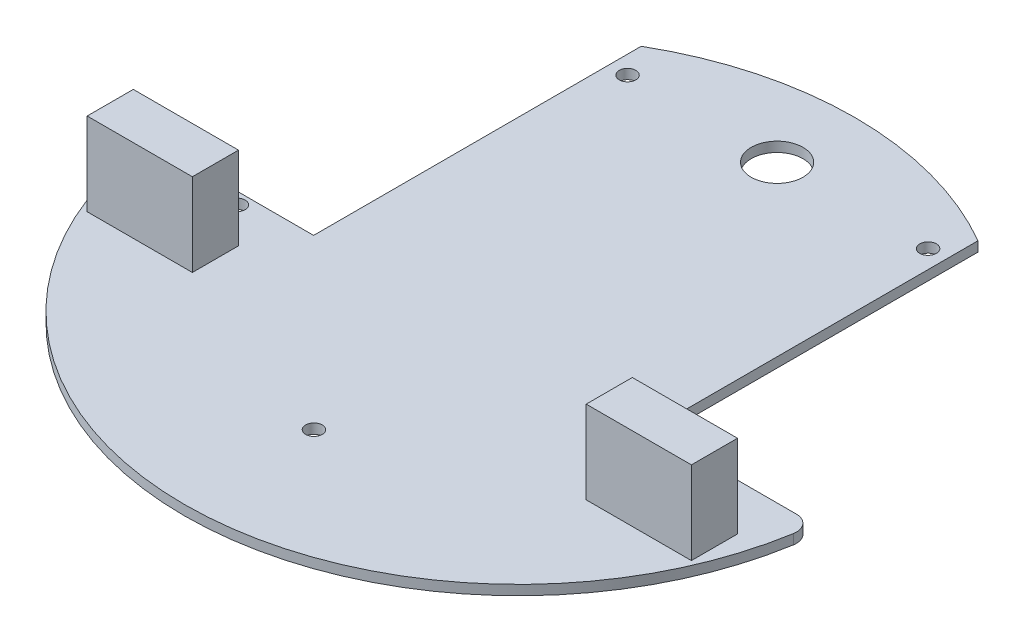
ISO-10303-21;
HEADER;
FILE_DESCRIPTION(('STEP AP214'),'2;1');
FILE_NAME('part.step','',(''),(''),'','','');
FILE_SCHEMA(('AUTOMOTIVE_DESIGN { 1 0 10303 214 1 1 1 1 }'));
ENDSEC;
DATA;
#1=APPLICATION_CONTEXT('core data for automotive mechanical design processes');
#2=APPLICATION_PROTOCOL_DEFINITION('international standard','automotive_design',2000,#1);
#3=PRODUCT_CONTEXT('',#1,'mechanical');
#4=PRODUCT('Part','Part','',(#3));
#5=PRODUCT_RELATED_PRODUCT_CATEGORY('part','',(#4));
#6=PRODUCT_DEFINITION_FORMATION('','',#4);
#7=PRODUCT_DEFINITION_CONTEXT('part definition',#1,'design');
#8=PRODUCT_DEFINITION('design','',#6,#7);
#9=PRODUCT_DEFINITION_SHAPE('','',#8);
#10=(LENGTH_UNIT() NAMED_UNIT(*) SI_UNIT(.MILLI.,.METRE.));
#11=(NAMED_UNIT(*) PLANE_ANGLE_UNIT() SI_UNIT($,.RADIAN.));
#12=(NAMED_UNIT(*) SI_UNIT($,.STERADIAN.) SOLID_ANGLE_UNIT());
#13=UNCERTAINTY_MEASURE_WITH_UNIT(LENGTH_MEASURE(1.E-05),#10,'distance_accuracy_value','');
#14=(GEOMETRIC_REPRESENTATION_CONTEXT(3) GLOBAL_UNCERTAINTY_ASSIGNED_CONTEXT((#13)) GLOBAL_UNIT_ASSIGNED_CONTEXT((#10,
#11,#12)) REPRESENTATION_CONTEXT('',''));
#15=CARTESIAN_POINT('',(0.,0.,0.));
#16=DIRECTION('',(0.,0.,1.));
#17=DIRECTION('',(1.,0.,0.));
#18=AXIS2_PLACEMENT_3D('',#15,#16,#17);
#19=CARTESIAN_POINT('',(0.,1.9,0.));
#20=DIRECTION('',(0.,-1.,0.));
#21=DIRECTION('',(0.,0.,-1.));
#22=AXIS2_PLACEMENT_3D('',#19,#20,#21);
#23=PLANE('',#22);
#24=DIRECTION('',(0.,0.,-1.));
#25=VECTOR('',#24,1.);
#26=CARTESIAN_POINT('',(58.3,1.9,42.2748186237033));
#27=LINE('',#26,#25);
#28=CARTESIAN_POINT('',(58.3,1.9,51.1748186237033));
#29=VERTEX_POINT('',#28);
#30=CARTESIAN_POINT('',(58.3,1.9,42.2748186237033));
#31=VERTEX_POINT('',#30);
#32=EDGE_CURVE('E168',#29,#31,#27,.T.);
#33=ORIENTED_EDGE('',*,*,#32,.F.);
#34=DIRECTION('',(1.,0.,0.));
#35=VECTOR('',#34,1.);
#36=CARTESIAN_POINT('',(58.3,1.9,51.1748186237033));
#37=LINE('',#36,#35);
#38=CARTESIAN_POINT('',(38.,1.9,51.1748186237033));
#39=VERTEX_POINT('',#38);
#40=EDGE_CURVE('E181',#39,#29,#37,.T.);
#41=ORIENTED_EDGE('',*,*,#40,.F.);
#42=DIRECTION('',(0.,0.,1.));
#43=VECTOR('',#42,1.);
#44=CARTESIAN_POINT('',(38.,1.9,42.2748186237033));
#45=LINE('',#44,#43);
#46=CARTESIAN_POINT('',(38.,1.9,42.2748186237033));
#47=VERTEX_POINT('',#46);
#48=EDGE_CURVE('E190',#47,#39,#45,.T.);
#49=ORIENTED_EDGE('',*,*,#48,.F.);
#50=DIRECTION('',(-1.,0.,0.));
#51=VECTOR('',#50,1.);
#52=CARTESIAN_POINT('',(58.3,1.9,42.2748186237033));
#53=LINE('',#52,#51);
#54=EDGE_CURVE('E171',#31,#47,#53,.T.);
#55=ORIENTED_EDGE('',*,*,#54,.F.);
#56=EDGE_LOOP('',(#33,#41,#49,#55));
#57=FACE_BOUND('',#56,.T.);
#58=CARTESIAN_POINT('',(29.,1.9,-23.8048236912251));
#59=DIRECTION('',(0.,1.,0.));
#60=DIRECTION('',(0.,0.,-1.));
#61=AXIS2_PLACEMENT_3D('',#58,#59,#60);
#62=CIRCLE('',#61,1.6);
#63=CARTESIAN_POINT('',(29.,1.9,-25.4048236912251));
#64=VERTEX_POINT('',#63);
#65=EDGE_CURVE('E206',#64,#64,#62,.T.);
#66=ORIENTED_EDGE('',*,*,#65,.F.);
#67=EDGE_LOOP('',(#66));
#68=FACE_BOUND('',#67,.T.);
#69=CARTESIAN_POINT('',(-29.,1.9,-23.8048236912251));
#70=DIRECTION('',(0.,1.,0.));
#71=DIRECTION('',(0.,0.,1.));
#72=AXIS2_PLACEMENT_3D('',#69,#70,#71);
#73=CIRCLE('',#72,1.6);
#74=CARTESIAN_POINT('',(-29.,1.9,-22.2048236912251));
#75=VERTEX_POINT('',#74);
#76=EDGE_CURVE('E212',#75,#75,#73,.T.);
#77=ORIENTED_EDGE('',*,*,#76,.F.);
#78=EDGE_LOOP('',(#77));
#79=FACE_BOUND('',#78,.T.);
#80=CARTESIAN_POINT('',(45.,1.9,35.5743022047236));
#81=DIRECTION('',(0.,1.,0.));
#82=DIRECTION('',(0.,0.,-1.));
#83=AXIS2_PLACEMENT_3D('',#80,#81,#82);
#84=CIRCLE('',#83,1.6);
#85=CARTESIAN_POINT('',(45.,1.9,33.9743022047236));
#86=VERTEX_POINT('',#85);
#87=EDGE_CURVE('E218',#86,#86,#84,.T.);
#88=ORIENTED_EDGE('',*,*,#87,.F.);
#89=EDGE_LOOP('',(#88));
#90=FACE_BOUND('',#89,.T.);
#91=CARTESIAN_POINT('',(-44.9999999999999,1.9,35.5743022047236));
#92=DIRECTION('',(0.,1.,0.));
#93=DIRECTION('',(0.,0.,1.));
#94=AXIS2_PLACEMENT_3D('',#91,#92,#93);
#95=CIRCLE('',#94,1.6);
#96=CARTESIAN_POINT('',(-44.9999999999999,1.9,37.1743022047236));
#97=VERTEX_POINT('',#96);
#98=EDGE_CURVE('E224',#97,#97,#95,.T.);
#99=ORIENTED_EDGE('',*,*,#98,.F.);
#100=EDGE_LOOP('',(#99));
#101=FACE_BOUND('',#100,.T.);
#102=CARTESIAN_POINT('',(0.,1.9,65.7186660190556));
#103=DIRECTION('',(0.,1.,0.));
#104=DIRECTION('',(0.,0.,1.));
#105=AXIS2_PLACEMENT_3D('',#102,#103,#104);
#106=CIRCLE('',#105,1.6);
#107=CARTESIAN_POINT('',(0.,1.9,67.3186660190556));
#108=VERTEX_POINT('',#107);
#109=EDGE_CURVE('E230',#108,#108,#106,.T.);
#110=ORIENTED_EDGE('',*,*,#109,.F.);
#111=EDGE_LOOP('',(#110));
#112=FACE_BOUND('',#111,.T.);
#113=CARTESIAN_POINT('',(0.,1.9,-23.660459876893));
#114=DIRECTION('',(0.,1.,0.));
#115=DIRECTION('',(0.,0.,1.));
#116=AXIS2_PLACEMENT_3D('',#113,#114,#115);
#117=CIRCLE('',#116,5.);
#118=CARTESIAN_POINT('',(0.,1.9,-18.660459876893));
#119=VERTEX_POINT('',#118);
#120=EDGE_CURVE('E236',#119,#119,#117,.T.);
#121=ORIENTED_EDGE('',*,*,#120,.F.);
#122=EDGE_LOOP('',(#121));
#123=FACE_BOUND('',#122,.T.);
#124=DIRECTION('',(0.,0.,1.));
#125=VECTOR('',#124,1.);
#126=CARTESIAN_POINT('',(32.5,1.9,-26.7251813762967));
#127=LINE('',#126,#125);
#128=CARTESIAN_POINT('',(32.5,1.9,-29.933368467883));
#129=VERTEX_POINT('',#128);
#130=CARTESIAN_POINT('',(32.5,1.9,33.2748186237033));
#131=VERTEX_POINT('',#130);
#132=EDGE_CURVE('E252',#129,#131,#127,.T.);
#133=ORIENTED_EDGE('',*,*,#132,.F.);
#134=CARTESIAN_POINT('',(-1.65310506335159E-13,1.9,26.2186660190557));
#135=DIRECTION('',(0.,-1.,0.));
#136=DIRECTION('',(0.,0.,1.));
#137=AXIS2_PLACEMENT_3D('',#134,#135,#136);
#138=CIRCLE('',#137,64.8791258959487);
#139=CARTESIAN_POINT('',(-32.5,1.9,-29.9333684678832));
#140=VERTEX_POINT('',#139);
#141=EDGE_CURVE('E249',#140,#129,#138,.T.);
#142=ORIENTED_EDGE('',*,*,#141,.F.);
#143=DIRECTION('',(0.,0.,-1.));
#144=VECTOR('',#143,1.);
#145=CARTESIAN_POINT('',(-32.5,1.9,-26.7251813762967));
#146=LINE('',#145,#144);
#147=CARTESIAN_POINT('',(-32.5,1.9,33.2748186237033));
#148=VERTEX_POINT('',#147);
#149=EDGE_CURVE('E271',#148,#140,#146,.T.);
#150=ORIENTED_EDGE('',*,*,#149,.F.);
#151=DIRECTION('',(1.,0.,0.));
#152=VECTOR('',#151,1.);
#153=CARTESIAN_POINT('',(-32.5,1.9,33.2748186237033));
#154=LINE('',#153,#152);
#155=CARTESIAN_POINT('',(-60.6722654496439,1.9,33.2748186237033));
#156=VERTEX_POINT('',#155);
#157=EDGE_CURVE('E268',#156,#148,#154,.T.);
#158=ORIENTED_EDGE('',*,*,#157,.F.);
#159=CARTESIAN_POINT('',(-60.6722654496439,1.9,36.2748186237033));
#160=DIRECTION('',(0.,-1.,0.));
#161=DIRECTION('',(0.,0.,1.));
#162=AXIS2_PLACEMENT_3D('',#159,#160,#161);
#163=CIRCLE('',#162,3.);
#164=CARTESIAN_POINT('',(-63.6318881545046,1.9,36.7653626531983));
#165=VERTEX_POINT('',#164);
#166=EDGE_CURVE('E265',#165,#156,#163,.T.);
#167=ORIENTED_EDGE('',*,*,#166,.F.);
#168=CARTESIAN_POINT('',(-1.65310506335159E-13,1.9,26.2186660190557));
#169=DIRECTION('',(0.,-1.,0.));
#170=DIRECTION('',(0.,0.,-1.));
#171=AXIS2_PLACEMENT_3D('',#168,#169,#170);
#172=CIRCLE('',#171,64.5);
#173=CARTESIAN_POINT('',(63.6318881545043,1.9,36.7653626531983));
#174=VERTEX_POINT('',#173);
#175=EDGE_CURVE('E262',#174,#165,#172,.T.);
#176=ORIENTED_EDGE('',*,*,#175,.F.);
#177=CARTESIAN_POINT('',(60.6722654496436,1.9,36.2748186237033));
#178=DIRECTION('',(0.,-1.,0.));
#179=DIRECTION('',(0.,0.,-1.));
#180=AXIS2_PLACEMENT_3D('',#177,#178,#179);
#181=CIRCLE('',#180,3.00000000000001);
#182=CARTESIAN_POINT('',(60.6722654496436,1.9,33.2748186237033));
#183=VERTEX_POINT('',#182);
#184=EDGE_CURVE('E259',#183,#174,#181,.T.);
#185=ORIENTED_EDGE('',*,*,#184,.F.);
#186=DIRECTION('',(1.,0.,0.));
#187=VECTOR('',#186,1.);
#188=CARTESIAN_POINT('',(32.5,1.9,33.2748186237033));
#189=LINE('',#188,#187);
#190=EDGE_CURVE('E256',#131,#183,#189,.T.);
#191=ORIENTED_EDGE('',*,*,#190,.F.);
#192=EDGE_LOOP('',(#133,#142,#150,#158,#167,#176,#185,#191));
#193=FACE_BOUND('',#192,.T.);
#194=DIRECTION('',(-1.,0.,0.));
#195=VECTOR('',#194,1.);
#196=CARTESIAN_POINT('',(-58.3,1.9,42.2748186237033));
#197=LINE('',#196,#195);
#198=CARTESIAN_POINT('',(-38.,1.9,42.2748186237033));
#199=VERTEX_POINT('',#198);
#200=CARTESIAN_POINT('',(-58.3,1.9,42.2748186237033));
#201=VERTEX_POINT('',#200);
#202=EDGE_CURVE('E167',#199,#201,#197,.T.);
#203=ORIENTED_EDGE('',*,*,#202,.F.);
#204=DIRECTION('',(0.,0.,-1.));
#205=VECTOR('',#204,1.);
#206=CARTESIAN_POINT('',(-38.,1.9,42.2748186237033));
#207=LINE('',#206,#205);
#208=CARTESIAN_POINT('',(-38.,1.9,51.1748186237033));
#209=VERTEX_POINT('',#208);
#210=EDGE_CURVE('E164',#209,#199,#207,.T.);
#211=ORIENTED_EDGE('',*,*,#210,.F.);
#212=DIRECTION('',(1.,0.,0.));
#213=VECTOR('',#212,1.);
#214=CARTESIAN_POINT('',(-58.3,1.9,51.1748186237033));
#215=LINE('',#214,#213);
#216=CARTESIAN_POINT('',(-58.3,1.9,51.1748186237033));
#217=VERTEX_POINT('',#216);
#218=EDGE_CURVE('E55',#217,#209,#215,.T.);
#219=ORIENTED_EDGE('',*,*,#218,.F.);
#220=DIRECTION('',(0.,0.,1.));
#221=VECTOR('',#220,1.);
#222=CARTESIAN_POINT('',(-58.3,1.9,42.2748186237033));
#223=LINE('',#222,#221);
#224=EDGE_CURVE('E50',#201,#217,#223,.T.);
#225=ORIENTED_EDGE('',*,*,#224,.F.);
#226=EDGE_LOOP('',(#203,#211,#219,#225));
#227=FACE_BOUND('',#226,.T.);
#228=ADVANCED_FACE('F33',(#57,#68,#79,#90,#101,#112,#123,#193,#227),#23,.F.);
#229=CARTESIAN_POINT('',(-1.65310506335159E-13,1.9,26.2186660190557));
#230=DIRECTION('',(0.,-1.,0.));
#231=DIRECTION('',(0.,0.,-1.));
#232=AXIS2_PLACEMENT_3D('',#229,#230,#231);
#233=CYLINDRICAL_SURFACE('',#232,64.8791258959487);
#234=DIRECTION('',(0.,-1.,0.));
#235=VECTOR('',#234,1.);
#236=CARTESIAN_POINT('',(32.5,1.9,-29.933368467883));
#237=LINE('',#236,#235);
#238=CARTESIAN_POINT('',(32.5,0.,-29.933368467883));
#239=VERTEX_POINT('',#238);
#240=EDGE_CURVE('E242',#239,#129,#237,.F.);
#241=ORIENTED_EDGE('',*,*,#240,.F.);
#242=CARTESIAN_POINT('',(-1.65310506335159E-13,0.,26.2186660190557));
#243=DIRECTION('',(0.,-1.,0.));
#244=DIRECTION('',(0.,0.,1.));
#245=AXIS2_PLACEMENT_3D('',#242,#243,#244);
#246=CIRCLE('',#245,64.8791258959487);
#247=CARTESIAN_POINT('',(-32.5,0.,-29.9333684678832));
#248=VERTEX_POINT('',#247);
#249=EDGE_CURVE('E248',#248,#239,#246,.T.);
#250=ORIENTED_EDGE('',*,*,#249,.F.);
#251=DIRECTION('',(0.,-1.,0.));
#252=VECTOR('',#251,1.);
#253=CARTESIAN_POINT('',(-32.5,1.9,-29.9333684678832));
#254=LINE('',#253,#252);
#255=EDGE_CURVE('E245',#140,#248,#254,.T.);
#256=ORIENTED_EDGE('',*,*,#255,.F.);
#257=ORIENTED_EDGE('',*,*,#141,.T.);
#258=EDGE_LOOP('',(#241,#250,#256,#257));
#259=FACE_BOUND('',#258,.T.);
#260=ADVANCED_FACE('F312',(#259),#233,.T.);
#261=CARTESIAN_POINT('',(-32.5,1.9,-26.7251813762967));
#262=DIRECTION('',(-1.,0.,0.));
#263=DIRECTION('',(0.,0.,1.));
#264=AXIS2_PLACEMENT_3D('',#261,#262,#263);
#265=PLANE('',#264);
#266=DIRECTION('',(0.,0.,-1.));
#267=VECTOR('',#266,1.);
#268=CARTESIAN_POINT('',(-32.5,0.,-26.7251813762967));
#269=LINE('',#268,#267);
#270=CARTESIAN_POINT('',(-32.5,0.,33.2748186237033));
#271=VERTEX_POINT('',#270);
#272=EDGE_CURVE('E253',#271,#248,#269,.T.);
#273=ORIENTED_EDGE('',*,*,#272,.F.);
#274=DIRECTION('',(0.,-1.,0.));
#275=VECTOR('',#274,1.);
#276=CARTESIAN_POINT('',(-32.5,1.9,33.2748186237033));
#277=LINE('',#276,#275);
#278=EDGE_CURVE('E11',#148,#271,#277,.T.);
#279=ORIENTED_EDGE('',*,*,#278,.F.);
#280=ORIENTED_EDGE('',*,*,#149,.T.);
#281=ORIENTED_EDGE('',*,*,#255,.T.);
#282=EDGE_LOOP('',(#273,#279,#280,#281));
#283=FACE_BOUND('',#282,.T.);
#284=ADVANCED_FACE('F332',(#283),#265,.T.);
#285=CARTESIAN_POINT('',(-32.5,1.9,33.2748186237033));
#286=DIRECTION('',(0.,0.,-1.));
#287=DIRECTION('',(-1.,0.,0.));
#288=AXIS2_PLACEMENT_3D('',#285,#286,#287);
#289=PLANE('',#288);
#290=DIRECTION('',(1.,0.,0.));
#291=VECTOR('',#290,1.);
#292=CARTESIAN_POINT('',(-32.5,0.,33.2748186237033));
#293=LINE('',#292,#291);
#294=CARTESIAN_POINT('',(-60.6722654496439,0.,33.2748186237033));
#295=VERTEX_POINT('',#294);
#296=EDGE_CURVE('E290',#295,#271,#293,.T.);
#297=ORIENTED_EDGE('',*,*,#296,.F.);
#298=DIRECTION('',(0.,-1.,0.));
#299=VECTOR('',#298,1.);
#300=CARTESIAN_POINT('',(-60.6722654496439,1.9,33.2748186237033));
#301=LINE('',#300,#299);
#302=EDGE_CURVE('E42',#156,#295,#301,.T.);
#303=ORIENTED_EDGE('',*,*,#302,.F.);
#304=ORIENTED_EDGE('',*,*,#157,.T.);
#305=ORIENTED_EDGE('',*,*,#278,.T.);
#306=EDGE_LOOP('',(#297,#303,#304,#305));
#307=FACE_BOUND('',#306,.T.);
#308=ADVANCED_FACE('F330',(#307),#289,.T.);
#309=CARTESIAN_POINT('',(-60.6722654496439,1.9,36.2748186237033));
#310=DIRECTION('',(0.,-1.,0.));
#311=DIRECTION('',(0.,0.,-1.));
#312=AXIS2_PLACEMENT_3D('',#309,#310,#311);
#313=CYLINDRICAL_SURFACE('',#312,3.);
#314=CARTESIAN_POINT('',(-60.6722654496439,0.,36.2748186237033));
#315=DIRECTION('',(0.,-1.,0.));
#316=DIRECTION('',(0.,0.,1.));
#317=AXIS2_PLACEMENT_3D('',#314,#315,#316);
#318=CIRCLE('',#317,3.);
#319=CARTESIAN_POINT('',(-63.6318881545046,0.,36.7653626531983));
#320=VERTEX_POINT('',#319);
#321=EDGE_CURVE('E287',#320,#295,#318,.T.);
#322=ORIENTED_EDGE('',*,*,#321,.F.);
#323=DIRECTION('',(0.,-1.,0.));
#324=VECTOR('',#323,1.);
#325=CARTESIAN_POINT('',(-63.6318881545046,1.9,36.7653626531983));
#326=LINE('',#325,#324);
#327=EDGE_CURVE('E295',#165,#320,#326,.T.);
#328=ORIENTED_EDGE('',*,*,#327,.F.);
#329=ORIENTED_EDGE('',*,*,#166,.T.);
#330=ORIENTED_EDGE('',*,*,#302,.T.);
#331=EDGE_LOOP('',(#322,#328,#329,#330));
#332=FACE_BOUND('',#331,.T.);
#333=ADVANCED_FACE('F327',(#332),#313,.T.);
#334=CARTESIAN_POINT('',(-1.65310506335159E-13,1.9,26.2186660190557));
#335=DIRECTION('',(0.,-1.,0.));
#336=DIRECTION('',(0.,0.,-1.));
#337=AXIS2_PLACEMENT_3D('',#334,#335,#336);
#338=CYLINDRICAL_SURFACE('',#337,64.5);
#339=CARTESIAN_POINT('',(-1.65310506335159E-13,0.,26.2186660190557));
#340=DIRECTION('',(0.,-1.,0.));
#341=DIRECTION('',(0.,0.,-1.));
#342=AXIS2_PLACEMENT_3D('',#339,#340,#341);
#343=CIRCLE('',#342,64.5);
#344=CARTESIAN_POINT('',(63.6318881545043,0.,36.7653626531983));
#345=VERTEX_POINT('',#344);
#346=EDGE_CURVE('E284',#345,#320,#343,.T.);
#347=ORIENTED_EDGE('',*,*,#346,.F.);
#348=DIRECTION('',(0.,-1.,0.));
#349=VECTOR('',#348,1.);
#350=CARTESIAN_POINT('',(63.6318881545043,1.9,36.7653626531983));
#351=LINE('',#350,#349);
#352=EDGE_CURVE('E297',#174,#345,#351,.T.);
#353=ORIENTED_EDGE('',*,*,#352,.F.);
#354=ORIENTED_EDGE('',*,*,#175,.T.);
#355=ORIENTED_EDGE('',*,*,#327,.T.);
#356=EDGE_LOOP('',(#347,#353,#354,#355));
#357=FACE_BOUND('',#356,.T.);
#358=ADVANCED_FACE('F325',(#357),#338,.T.);
#359=CARTESIAN_POINT('',(60.6722654496436,1.9,36.2748186237033));
#360=DIRECTION('',(0.,-1.,0.));
#361=DIRECTION('',(0.,0.,-1.));
#362=AXIS2_PLACEMENT_3D('',#359,#360,#361);
#363=CYLINDRICAL_SURFACE('',#362,3.00000000000001);
#364=CARTESIAN_POINT('',(60.6722654496436,0.,36.2748186237033));
#365=DIRECTION('',(0.,-1.,0.));
#366=DIRECTION('',(0.,0.,-1.));
#367=AXIS2_PLACEMENT_3D('',#364,#365,#366);
#368=CIRCLE('',#367,3.00000000000001);
#369=CARTESIAN_POINT('',(60.6722654496436,0.,33.2748186237033));
#370=VERTEX_POINT('',#369);
#371=EDGE_CURVE('E281',#370,#345,#368,.T.);
#372=ORIENTED_EDGE('',*,*,#371,.F.);
#373=DIRECTION('',(0.,-1.,0.));
#374=VECTOR('',#373,1.);
#375=CARTESIAN_POINT('',(60.6722654496436,1.9,33.2748186237033));
#376=LINE('',#375,#374);
#377=EDGE_CURVE('E298',#183,#370,#376,.T.);
#378=ORIENTED_EDGE('',*,*,#377,.F.);
#379=ORIENTED_EDGE('',*,*,#184,.T.);
#380=ORIENTED_EDGE('',*,*,#352,.T.);
#381=EDGE_LOOP('',(#372,#378,#379,#380));
#382=FACE_BOUND('',#381,.T.);
#383=ADVANCED_FACE('F321',(#382),#363,.T.);
#384=CARTESIAN_POINT('',(32.5,1.9,33.2748186237033));
#385=DIRECTION('',(0.,0.,-1.));
#386=DIRECTION('',(-1.,0.,0.));
#387=AXIS2_PLACEMENT_3D('',#384,#385,#386);
#388=PLANE('',#387);
#389=DIRECTION('',(1.,0.,0.));
#390=VECTOR('',#389,1.);
#391=CARTESIAN_POINT('',(32.5,0.,33.2748186237033));
#392=LINE('',#391,#390);
#393=CARTESIAN_POINT('',(32.5,0.,33.2748186237033));
#394=VERTEX_POINT('',#393);
#395=EDGE_CURVE('E278',#394,#370,#392,.T.);
#396=ORIENTED_EDGE('',*,*,#395,.F.);
#397=DIRECTION('',(0.,-1.,0.));
#398=VECTOR('',#397,1.);
#399=CARTESIAN_POINT('',(32.5,1.9,33.2748186237033));
#400=LINE('',#399,#398);
#401=EDGE_CURVE('E37',#131,#394,#400,.T.);
#402=ORIENTED_EDGE('',*,*,#401,.F.);
#403=ORIENTED_EDGE('',*,*,#190,.T.);
#404=ORIENTED_EDGE('',*,*,#377,.T.);
#405=EDGE_LOOP('',(#396,#402,#403,#404));
#406=FACE_BOUND('',#405,.T.);
#407=ADVANCED_FACE('F306',(#406),#388,.T.);
#408=CARTESIAN_POINT('',(32.5,1.9,-26.7251813762967));
#409=DIRECTION('',(1.,0.,0.));
#410=DIRECTION('',(0.,0.,-1.));
#411=AXIS2_PLACEMENT_3D('',#408,#409,#410);
#412=PLANE('',#411);
#413=DIRECTION('',(0.,0.,1.));
#414=VECTOR('',#413,1.);
#415=CARTESIAN_POINT('',(32.5,0.,-26.7251813762967));
#416=LINE('',#415,#414);
#417=EDGE_CURVE('E275',#239,#394,#416,.T.);
#418=ORIENTED_EDGE('',*,*,#417,.F.);
#419=ORIENTED_EDGE('',*,*,#240,.T.);
#420=ORIENTED_EDGE('',*,*,#132,.T.);
#421=ORIENTED_EDGE('',*,*,#401,.T.);
#422=EDGE_LOOP('',(#418,#419,#420,#421));
#423=FACE_BOUND('',#422,.T.);
#424=ADVANCED_FACE('F303',(#423),#412,.T.);
#425=CARTESIAN_POINT('',(0.,0.,0.));
#426=DIRECTION('',(0.,-1.,0.));
#427=DIRECTION('',(0.,0.,-1.));
#428=AXIS2_PLACEMENT_3D('',#425,#426,#427);
#429=PLANE('',#428);
#430=CARTESIAN_POINT('',(29.,0.,-23.8048236912251));
#431=DIRECTION('',(0.,-1.,0.));
#432=DIRECTION('',(0.,0.,-1.));
#433=AXIS2_PLACEMENT_3D('',#430,#431,#432);
#434=CIRCLE('',#433,1.6);
#435=CARTESIAN_POINT('',(29.,0.,-25.4048236912251));
#436=VERTEX_POINT('',#435);
#437=EDGE_CURVE('E209',#436,#436,#434,.F.);
#438=ORIENTED_EDGE('',*,*,#437,.T.);
#439=EDGE_LOOP('',(#438));
#440=FACE_BOUND('',#439,.T.);
#441=CARTESIAN_POINT('',(-29.,0.,-23.8048236912251));
#442=DIRECTION('',(0.,-1.,0.));
#443=DIRECTION('',(0.,0.,-1.));
#444=AXIS2_PLACEMENT_3D('',#441,#442,#443);
#445=CIRCLE('',#444,1.6);
#446=CARTESIAN_POINT('',(-29.,0.,-25.4048236912251));
#447=VERTEX_POINT('',#446);
#448=EDGE_CURVE('E215',#447,#447,#445,.F.);
#449=ORIENTED_EDGE('',*,*,#448,.T.);
#450=EDGE_LOOP('',(#449));
#451=FACE_BOUND('',#450,.T.);
#452=CARTESIAN_POINT('',(45.,0.,35.5743022047236));
#453=DIRECTION('',(0.,-1.,0.));
#454=DIRECTION('',(0.,0.,-1.));
#455=AXIS2_PLACEMENT_3D('',#452,#453,#454);
#456=CIRCLE('',#455,1.6);
#457=CARTESIAN_POINT('',(45.,0.,33.9743022047236));
#458=VERTEX_POINT('',#457);
#459=EDGE_CURVE('E221',#458,#458,#456,.F.);
#460=ORIENTED_EDGE('',*,*,#459,.T.);
#461=EDGE_LOOP('',(#460));
#462=FACE_BOUND('',#461,.T.);
#463=CARTESIAN_POINT('',(-44.9999999999999,0.,35.5743022047236));
#464=DIRECTION('',(0.,-1.,0.));
#465=DIRECTION('',(0.,0.,-1.));
#466=AXIS2_PLACEMENT_3D('',#463,#464,#465);
#467=CIRCLE('',#466,1.6);
#468=CARTESIAN_POINT('',(-44.9999999999999,0.,33.9743022047236));
#469=VERTEX_POINT('',#468);
#470=EDGE_CURVE('E227',#469,#469,#467,.F.);
#471=ORIENTED_EDGE('',*,*,#470,.T.);
#472=EDGE_LOOP('',(#471));
#473=FACE_BOUND('',#472,.T.);
#474=CARTESIAN_POINT('',(0.,0.,65.7186660190556));
#475=DIRECTION('',(0.,-1.,0.));
#476=DIRECTION('',(0.,0.,-1.));
#477=AXIS2_PLACEMENT_3D('',#474,#475,#476);
#478=CIRCLE('',#477,1.6);
#479=CARTESIAN_POINT('',(0.,0.,64.1186660190556));
#480=VERTEX_POINT('',#479);
#481=EDGE_CURVE('E233',#480,#480,#478,.F.);
#482=ORIENTED_EDGE('',*,*,#481,.T.);
#483=EDGE_LOOP('',(#482));
#484=FACE_BOUND('',#483,.T.);
#485=CARTESIAN_POINT('',(0.,0.,-23.660459876893));
#486=DIRECTION('',(0.,-1.,0.));
#487=DIRECTION('',(0.,0.,-1.));
#488=AXIS2_PLACEMENT_3D('',#485,#486,#487);
#489=CIRCLE('',#488,5.);
#490=CARTESIAN_POINT('',(0.,0.,-28.660459876893));
#491=VERTEX_POINT('',#490);
#492=EDGE_CURVE('E239',#491,#491,#489,.F.);
#493=ORIENTED_EDGE('',*,*,#492,.T.);
#494=EDGE_LOOP('',(#493));
#495=FACE_BOUND('',#494,.T.);
#496=ORIENTED_EDGE('',*,*,#249,.T.);
#497=ORIENTED_EDGE('',*,*,#417,.T.);
#498=ORIENTED_EDGE('',*,*,#395,.T.);
#499=ORIENTED_EDGE('',*,*,#371,.T.);
#500=ORIENTED_EDGE('',*,*,#346,.T.);
#501=ORIENTED_EDGE('',*,*,#321,.T.);
#502=ORIENTED_EDGE('',*,*,#296,.T.);
#503=ORIENTED_EDGE('',*,*,#272,.T.);
#504=EDGE_LOOP('',(#496,#497,#498,#499,#500,#501,#502,#503));
#505=FACE_BOUND('',#504,.T.);
#506=ADVANCED_FACE('F35',(#440,#451,#462,#473,#484,#495,#505),#429,.T.);
#507=CARTESIAN_POINT('',(0.,-14.142135623731,-23.660459876893));
#508=DIRECTION('',(0.,1.,0.));
#509=DIRECTION('',(0.,0.,1.));
#510=AXIS2_PLACEMENT_3D('',#507,#508,#509);
#511=CYLINDRICAL_SURFACE('',#510,5.);
#512=ORIENTED_EDGE('',*,*,#120,.T.);
#513=EDGE_LOOP('',(#512));
#514=FACE_BOUND('',#513,.T.);
#515=ORIENTED_EDGE('',*,*,#492,.F.);
#516=EDGE_LOOP('',(#515));
#517=FACE_BOUND('',#516,.T.);
#518=ADVANCED_FACE('F385',(#514,#517),#511,.F.);
#519=CARTESIAN_POINT('',(0.,-4.52548339959391,65.7186660190556));
#520=DIRECTION('',(0.,1.,0.));
#521=DIRECTION('',(0.,0.,1.));
#522=AXIS2_PLACEMENT_3D('',#519,#520,#521);
#523=CYLINDRICAL_SURFACE('',#522,1.6);
#524=ORIENTED_EDGE('',*,*,#109,.T.);
#525=EDGE_LOOP('',(#524));
#526=FACE_BOUND('',#525,.T.);
#527=ORIENTED_EDGE('',*,*,#481,.F.);
#528=EDGE_LOOP('',(#527));
#529=FACE_BOUND('',#528,.T.);
#530=ADVANCED_FACE('F392',(#526,#529),#523,.F.);
#531=CARTESIAN_POINT('',(-44.9999999999999,-4.52548339959391,35.5743022047236));
#532=DIRECTION('',(0.,1.,0.));
#533=DIRECTION('',(0.,0.,1.));
#534=AXIS2_PLACEMENT_3D('',#531,#532,#533);
#535=CYLINDRICAL_SURFACE('',#534,1.6);
#536=ORIENTED_EDGE('',*,*,#98,.T.);
#537=EDGE_LOOP('',(#536));
#538=FACE_BOUND('',#537,.T.);
#539=ORIENTED_EDGE('',*,*,#470,.F.);
#540=EDGE_LOOP('',(#539));
#541=FACE_BOUND('',#540,.T.);
#542=ADVANCED_FACE('F398',(#538,#541),#535,.F.);
#543=CARTESIAN_POINT('',(45.,-4.52548339959391,35.5743022047236));
#544=DIRECTION('',(0.,1.,0.));
#545=DIRECTION('',(0.,0.,1.));
#546=AXIS2_PLACEMENT_3D('',#543,#544,#545);
#547=CYLINDRICAL_SURFACE('',#546,1.6);
#548=ORIENTED_EDGE('',*,*,#87,.T.);
#549=EDGE_LOOP('',(#548));
#550=FACE_BOUND('',#549,.T.);
#551=ORIENTED_EDGE('',*,*,#459,.F.);
#552=EDGE_LOOP('',(#551));
#553=FACE_BOUND('',#552,.T.);
#554=ADVANCED_FACE('F406',(#550,#553),#547,.F.);
#555=CARTESIAN_POINT('',(-29.,-4.52548339959391,-23.8048236912251));
#556=DIRECTION('',(0.,1.,0.));
#557=DIRECTION('',(0.,0.,1.));
#558=AXIS2_PLACEMENT_3D('',#555,#556,#557);
#559=CYLINDRICAL_SURFACE('',#558,1.6);
#560=ORIENTED_EDGE('',*,*,#76,.T.);
#561=EDGE_LOOP('',(#560));
#562=FACE_BOUND('',#561,.T.);
#563=ORIENTED_EDGE('',*,*,#448,.F.);
#564=EDGE_LOOP('',(#563));
#565=FACE_BOUND('',#564,.T.);
#566=ADVANCED_FACE('F414',(#562,#565),#559,.F.);
#567=CARTESIAN_POINT('',(29.,-4.52548339959391,-23.8048236912251));
#568=DIRECTION('',(0.,1.,0.));
#569=DIRECTION('',(0.,0.,1.));
#570=AXIS2_PLACEMENT_3D('',#567,#568,#569);
#571=CYLINDRICAL_SURFACE('',#570,1.6);
#572=ORIENTED_EDGE('',*,*,#65,.T.);
#573=EDGE_LOOP('',(#572));
#574=FACE_BOUND('',#573,.T.);
#575=ORIENTED_EDGE('',*,*,#437,.F.);
#576=EDGE_LOOP('',(#575));
#577=FACE_BOUND('',#576,.T.);
#578=ADVANCED_FACE('F422',(#574,#577),#571,.F.);
#579=CARTESIAN_POINT('',(58.3,17.9,42.2748186237033));
#580=DIRECTION('',(-1.,0.,0.));
#581=DIRECTION('',(0.,0.,1.));
#582=AXIS2_PLACEMENT_3D('',#579,#580,#581);
#583=PLANE('',#582);
#584=ORIENTED_EDGE('',*,*,#32,.T.);
#585=DIRECTION('',(0.,-1.,0.));
#586=VECTOR('',#585,1.);
#587=CARTESIAN_POINT('',(58.3,17.9,42.2748186237033));
#588=LINE('',#587,#586);
#589=CARTESIAN_POINT('',(58.3,17.9,42.2748186237033));
#590=VERTEX_POINT('',#589);
#591=EDGE_CURVE('E203',#590,#31,#588,.T.);
#592=ORIENTED_EDGE('',*,*,#591,.F.);
#593=DIRECTION('',(0.,0.,-1.));
#594=VECTOR('',#593,1.);
#595=CARTESIAN_POINT('',(58.3,17.9,42.2748186237033));
#596=LINE('',#595,#594);
#597=CARTESIAN_POINT('',(58.3,17.9,51.1748186237033));
#598=VERTEX_POINT('',#597);
#599=EDGE_CURVE('E177',#598,#590,#596,.T.);
#600=ORIENTED_EDGE('',*,*,#599,.F.);
#601=DIRECTION('',(0.,-1.,0.));
#602=VECTOR('',#601,1.);
#603=CARTESIAN_POINT('',(58.3,17.9,51.1748186237033));
#604=LINE('',#603,#602);
#605=EDGE_CURVE('E186',#598,#29,#604,.T.);
#606=ORIENTED_EDGE('',*,*,#605,.T.);
#607=EDGE_LOOP('',(#584,#592,#600,#606));
#608=FACE_BOUND('',#607,.T.);
#609=ADVANCED_FACE('F430',(#608),#583,.F.);
#610=CARTESIAN_POINT('',(58.3,17.9,42.2748186237033));
#611=DIRECTION('',(0.,0.,1.));
#612=DIRECTION('',(1.,0.,0.));
#613=AXIS2_PLACEMENT_3D('',#610,#611,#612);
#614=PLANE('',#613);
#615=ORIENTED_EDGE('',*,*,#54,.T.);
#616=DIRECTION('',(0.,-1.,0.));
#617=VECTOR('',#616,1.);
#618=CARTESIAN_POINT('',(38.,17.9,42.2748186237033));
#619=LINE('',#618,#617);
#620=CARTESIAN_POINT('',(38.,17.9,42.2748186237033));
#621=VERTEX_POINT('',#620);
#622=EDGE_CURVE('E200',#621,#47,#619,.T.);
#623=ORIENTED_EDGE('',*,*,#622,.F.);
#624=DIRECTION('',(-1.,0.,0.));
#625=VECTOR('',#624,1.);
#626=CARTESIAN_POINT('',(58.3,17.9,42.2748186237033));
#627=LINE('',#626,#625);
#628=EDGE_CURVE('E180',#590,#621,#627,.T.);
#629=ORIENTED_EDGE('',*,*,#628,.F.);
#630=ORIENTED_EDGE('',*,*,#591,.T.);
#631=EDGE_LOOP('',(#615,#623,#629,#630));
#632=FACE_BOUND('',#631,.T.);
#633=ADVANCED_FACE('F438',(#632),#614,.F.);
#634=CARTESIAN_POINT('',(38.,17.9,42.2748186237033));
#635=DIRECTION('',(1.,0.,0.));
#636=DIRECTION('',(0.,0.,-1.));
#637=AXIS2_PLACEMENT_3D('',#634,#635,#636);
#638=PLANE('',#637);
#639=ORIENTED_EDGE('',*,*,#48,.T.);
#640=DIRECTION('',(0.,-1.,0.));
#641=VECTOR('',#640,1.);
#642=CARTESIAN_POINT('',(38.,17.9,51.1748186237033));
#643=LINE('',#642,#641);
#644=CARTESIAN_POINT('',(38.,17.9,51.1748186237033));
#645=VERTEX_POINT('',#644);
#646=EDGE_CURVE('E197',#645,#39,#643,.T.);
#647=ORIENTED_EDGE('',*,*,#646,.F.);
#648=DIRECTION('',(0.,0.,1.));
#649=VECTOR('',#648,1.);
#650=CARTESIAN_POINT('',(38.,17.9,42.2748186237033));
#651=LINE('',#650,#649);
#652=EDGE_CURVE('E183',#621,#645,#651,.T.);
#653=ORIENTED_EDGE('',*,*,#652,.F.);
#654=ORIENTED_EDGE('',*,*,#622,.T.);
#655=EDGE_LOOP('',(#639,#647,#653,#654));
#656=FACE_BOUND('',#655,.T.);
#657=ADVANCED_FACE('F446',(#656),#638,.F.);
#658=CARTESIAN_POINT('',(58.3,17.9,51.1748186237033));
#659=DIRECTION('',(0.,0.,-1.));
#660=DIRECTION('',(-1.,0.,0.));
#661=AXIS2_PLACEMENT_3D('',#658,#659,#660);
#662=PLANE('',#661);
#663=ORIENTED_EDGE('',*,*,#40,.T.);
#664=ORIENTED_EDGE('',*,*,#605,.F.);
#665=DIRECTION('',(1.,0.,0.));
#666=VECTOR('',#665,1.);
#667=CARTESIAN_POINT('',(58.3,17.9,51.1748186237033));
#668=LINE('',#667,#666);
#669=EDGE_CURVE('E185',#645,#598,#668,.T.);
#670=ORIENTED_EDGE('',*,*,#669,.F.);
#671=ORIENTED_EDGE('',*,*,#646,.T.);
#672=EDGE_LOOP('',(#663,#664,#670,#671));
#673=FACE_BOUND('',#672,.T.);
#674=ADVANCED_FACE('F454',(#673),#662,.F.);
#675=CARTESIAN_POINT('',(0.,17.9,0.));
#676=DIRECTION('',(0.,-1.,0.));
#677=DIRECTION('',(0.,0.,-1.));
#678=AXIS2_PLACEMENT_3D('',#675,#676,#677);
#679=PLANE('',#678);
#680=ORIENTED_EDGE('',*,*,#599,.T.);
#681=ORIENTED_EDGE('',*,*,#628,.T.);
#682=ORIENTED_EDGE('',*,*,#652,.T.);
#683=ORIENTED_EDGE('',*,*,#669,.T.);
#684=EDGE_LOOP('',(#680,#681,#682,#683));
#685=FACE_BOUND('',#684,.T.);
#686=ADVANCED_FACE('F462',(#685),#679,.F.);
#687=CARTESIAN_POINT('',(-58.3,17.9,42.2748186237033));
#688=DIRECTION('',(0.,0.,1.));
#689=DIRECTION('',(1.,0.,0.));
#690=AXIS2_PLACEMENT_3D('',#687,#688,#689);
#691=PLANE('',#690);
#692=ORIENTED_EDGE('',*,*,#202,.T.);
#693=DIRECTION('',(0.,-1.,0.));
#694=VECTOR('',#693,1.);
#695=CARTESIAN_POINT('',(-58.3,17.9,42.2748186237033));
#696=LINE('',#695,#694);
#697=CARTESIAN_POINT('',(-58.3,17.9,42.2748186237033));
#698=VERTEX_POINT('',#697);
#699=EDGE_CURVE('E148',#698,#201,#696,.T.);
#700=ORIENTED_EDGE('',*,*,#699,.F.);
#701=DIRECTION('',(-1.,0.,0.));
#702=VECTOR('',#701,1.);
#703=CARTESIAN_POINT('',(-58.3,17.9,42.2748186237033));
#704=LINE('',#703,#702);
#705=CARTESIAN_POINT('',(-38.,17.9,42.2748186237033));
#706=VERTEX_POINT('',#705);
#707=EDGE_CURVE('E155',#706,#698,#704,.T.);
#708=ORIENTED_EDGE('',*,*,#707,.F.);
#709=DIRECTION('',(0.,-1.,0.));
#710=VECTOR('',#709,1.);
#711=CARTESIAN_POINT('',(-38.,17.9,42.2748186237033));
#712=LINE('',#711,#710);
#713=EDGE_CURVE('E582',#706,#199,#712,.T.);
#714=ORIENTED_EDGE('',*,*,#713,.T.);
#715=EDGE_LOOP('',(#692,#700,#708,#714));
#716=FACE_BOUND('',#715,.T.);
#717=ADVANCED_FACE('F166',(#716),#691,.F.);
#718=CARTESIAN_POINT('',(-58.3,17.9,42.2748186237033));
#719=DIRECTION('',(1.,0.,0.));
#720=DIRECTION('',(0.,0.,-1.));
#721=AXIS2_PLACEMENT_3D('',#718,#719,#720);
#722=PLANE('',#721);
#723=ORIENTED_EDGE('',*,*,#224,.T.);
#724=DIRECTION('',(0.,-1.,0.));
#725=VECTOR('',#724,1.);
#726=CARTESIAN_POINT('',(-58.3,17.9,51.1748186237033));
#727=LINE('',#726,#725);
#728=CARTESIAN_POINT('',(-58.3,17.9,51.1748186237033));
#729=VERTEX_POINT('',#728);
#730=EDGE_CURVE('E151',#729,#217,#727,.T.);
#731=ORIENTED_EDGE('',*,*,#730,.F.);
#732=DIRECTION('',(0.,0.,1.));
#733=VECTOR('',#732,1.);
#734=CARTESIAN_POINT('',(-58.3,17.9,42.2748186237033));
#735=LINE('',#734,#733);
#736=EDGE_CURVE('E144',#698,#729,#735,.T.);
#737=ORIENTED_EDGE('',*,*,#736,.F.);
#738=ORIENTED_EDGE('',*,*,#699,.T.);
#739=EDGE_LOOP('',(#723,#731,#737,#738));
#740=FACE_BOUND('',#739,.T.);
#741=ADVANCED_FACE('F146',(#740),#722,.F.);
#742=CARTESIAN_POINT('',(-58.3,17.9,51.1748186237033));
#743=DIRECTION('',(0.,0.,-1.));
#744=DIRECTION('',(-1.,0.,0.));
#745=AXIS2_PLACEMENT_3D('',#742,#743,#744);
#746=PLANE('',#745);
#747=ORIENTED_EDGE('',*,*,#218,.T.);
#748=DIRECTION('',(0.,-1.,0.));
#749=VECTOR('',#748,1.);
#750=CARTESIAN_POINT('',(-38.,17.9,51.1748186237033));
#751=LINE('',#750,#749);
#752=CARTESIAN_POINT('',(-38.,17.9,51.1748186237033));
#753=VERTEX_POINT('',#752);
#754=EDGE_CURVE('E173',#753,#209,#751,.T.);
#755=ORIENTED_EDGE('',*,*,#754,.F.);
#756=DIRECTION('',(1.,0.,0.));
#757=VECTOR('',#756,1.);
#758=CARTESIAN_POINT('',(-58.3,17.9,51.1748186237033));
#759=LINE('',#758,#757);
#760=EDGE_CURVE('E154',#729,#753,#759,.T.);
#761=ORIENTED_EDGE('',*,*,#760,.F.);
#762=ORIENTED_EDGE('',*,*,#730,.T.);
#763=EDGE_LOOP('',(#747,#755,#761,#762));
#764=FACE_BOUND('',#763,.T.);
#765=ADVANCED_FACE('F483',(#764),#746,.F.);
#766=CARTESIAN_POINT('',(-38.,17.9,42.2748186237033));
#767=DIRECTION('',(-1.,0.,0.));
#768=DIRECTION('',(0.,0.,1.));
#769=AXIS2_PLACEMENT_3D('',#766,#767,#768);
#770=PLANE('',#769);
#771=ORIENTED_EDGE('',*,*,#210,.T.);
#772=ORIENTED_EDGE('',*,*,#713,.F.);
#773=DIRECTION('',(0.,0.,-1.));
#774=VECTOR('',#773,1.);
#775=CARTESIAN_POINT('',(-38.,17.9,42.2748186237033));
#776=LINE('',#775,#774);
#777=EDGE_CURVE('E160',#753,#706,#776,.T.);
#778=ORIENTED_EDGE('',*,*,#777,.F.);
#779=ORIENTED_EDGE('',*,*,#754,.T.);
#780=EDGE_LOOP('',(#771,#772,#778,#779));
#781=FACE_BOUND('',#780,.T.);
#782=ADVANCED_FACE('F490',(#781),#770,.F.);
#783=CARTESIAN_POINT('',(0.,17.9,0.));
#784=DIRECTION('',(0.,-1.,0.));
#785=DIRECTION('',(0.,0.,-1.));
#786=AXIS2_PLACEMENT_3D('',#783,#784,#785);
#787=PLANE('',#786);
#788=ORIENTED_EDGE('',*,*,#707,.T.);
#789=ORIENTED_EDGE('',*,*,#736,.T.);
#790=ORIENTED_EDGE('',*,*,#760,.T.);
#791=ORIENTED_EDGE('',*,*,#777,.T.);
#792=EDGE_LOOP('',(#788,#789,#790,#791));
#793=FACE_BOUND('',#792,.T.);
#794=ADVANCED_FACE('F158',(#793),#787,.F.);
#795=CLOSED_SHELL('',(#228,#260,#284,#308,#333,#358,#383,#407,#424,#506,#518,#530,#542,#554,
#566,#578,#609,#633,#657,#674,#686,#717,#741,#765,#782,#794));
#796=MANIFOLD_SOLID_BREP('B2',#795);
#797=ADVANCED_BREP_SHAPE_REPRESENTATION('',(#18,#796),#14);
#798=SHAPE_DEFINITION_REPRESENTATION(#9,#797);
ENDSEC;
END-ISO-10303-21;
